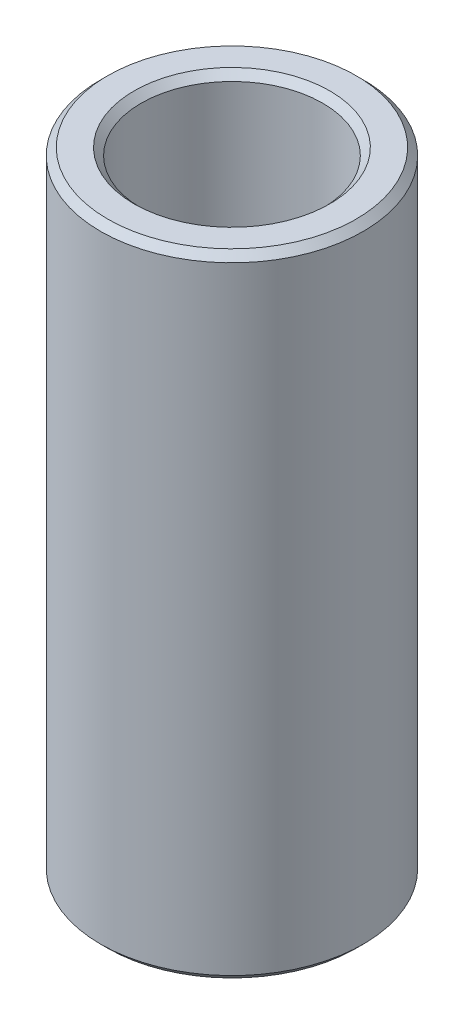
ISO-10303-21;
HEADER;
FILE_DESCRIPTION(('STEP AP214'),'2;1');
FILE_NAME('part.step','',(''),(''),'','','');
FILE_SCHEMA(('AUTOMOTIVE_DESIGN { 1 0 10303 214 1 1 1 1 }'));
ENDSEC;
DATA;
#1=APPLICATION_CONTEXT('core data for automotive mechanical design processes');
#2=APPLICATION_PROTOCOL_DEFINITION('international standard','automotive_design',2000,#1);
#3=PRODUCT_CONTEXT('',#1,'mechanical');
#4=PRODUCT('Part','Part','',(#3));
#5=PRODUCT_RELATED_PRODUCT_CATEGORY('part','',(#4));
#6=PRODUCT_DEFINITION_FORMATION('','',#4);
#7=PRODUCT_DEFINITION_CONTEXT('part definition',#1,'design');
#8=PRODUCT_DEFINITION('design','',#6,#7);
#9=PRODUCT_DEFINITION_SHAPE('','',#8);
#10=(LENGTH_UNIT() NAMED_UNIT(*) SI_UNIT(.MILLI.,.METRE.));
#11=(NAMED_UNIT(*) PLANE_ANGLE_UNIT() SI_UNIT($,.RADIAN.));
#12=(NAMED_UNIT(*) SI_UNIT($,.STERADIAN.) SOLID_ANGLE_UNIT());
#13=UNCERTAINTY_MEASURE_WITH_UNIT(LENGTH_MEASURE(1.E-05),#10,'distance_accuracy_value','');
#14=(GEOMETRIC_REPRESENTATION_CONTEXT(3) GLOBAL_UNCERTAINTY_ASSIGNED_CONTEXT((#13)) GLOBAL_UNIT_ASSIGNED_CONTEXT((#10,
#11,#12)) REPRESENTATION_CONTEXT('',''));
#15=CARTESIAN_POINT('',(0.,0.,0.));
#16=DIRECTION('',(0.,0.,1.));
#17=DIRECTION('',(1.,0.,0.));
#18=AXIS2_PLACEMENT_3D('',#15,#16,#17);
#19=CARTESIAN_POINT('',(0.,264.428492495998,0.));
#20=DIRECTION('',(0.,-1.,0.));
#21=DIRECTION('',(0.,0.,-1.));
#22=AXIS2_PLACEMENT_3D('',#19,#20,#21);
#23=CYLINDRICAL_SURFACE('',#22,55.);
#24=CARTESIAN_POINT('',(0.,2.97311401202482,0.));
#25=DIRECTION('',(0.,1.,0.));
#26=DIRECTION('',(0.,0.,1.));
#27=AXIS2_PLACEMENT_3D('',#24,#25,#26);
#28=CIRCLE('',#27,55.);
#29=CARTESIAN_POINT('',(0.,2.97311401202482,55.));
#30=VERTEX_POINT('',#29);
#31=EDGE_CURVE('E10',#30,#30,#28,.T.);
#32=ORIENTED_EDGE('',*,*,#31,.T.);
#33=EDGE_LOOP('',(#32));
#34=FACE_BOUND('',#33,.T.);
#35=CARTESIAN_POINT('',(0.,261.455378483974,0.));
#36=DIRECTION('',(0.,1.,0.));
#37=DIRECTION('',(0.,0.,1.));
#38=AXIS2_PLACEMENT_3D('',#35,#36,#37);
#39=CIRCLE('',#38,55.);
#40=CARTESIAN_POINT('',(0.,261.455378483974,55.));
#41=VERTEX_POINT('',#40);
#42=EDGE_CURVE('E50',#41,#41,#39,.F.);
#43=ORIENTED_EDGE('',*,*,#42,.T.);
#44=EDGE_LOOP('',(#43));
#45=FACE_BOUND('',#44,.T.);
#46=ADVANCED_FACE('F39',(#34,#45),#23,.T.);
#47=CARTESIAN_POINT('',(0.,264.428492495998,0.));
#48=DIRECTION('',(0.,1.,0.));
#49=DIRECTION('',(0.,0.,1.));
#50=AXIS2_PLACEMENT_3D('',#47,#48,#49);
#51=PLANE('',#50);
#52=CARTESIAN_POINT('',(0.,264.428492495998,0.));
#53=DIRECTION('',(0.,1.,0.));
#54=DIRECTION('',(0.,0.,1.));
#55=AXIS2_PLACEMENT_3D('',#52,#53,#54);
#56=CIRCLE('',#55,40.9981570646985);
#57=CARTESIAN_POINT('',(0.,264.428492495998,40.9981570646985));
#58=VERTEX_POINT('',#57);
#59=EDGE_CURVE('E58',#58,#58,#56,.F.);
#60=ORIENTED_EDGE('',*,*,#59,.T.);
#61=EDGE_LOOP('',(#60));
#62=FACE_BOUND('',#61,.T.);
#63=CARTESIAN_POINT('',(0.,264.428492495998,0.));
#64=DIRECTION('',(0.,1.,0.));
#65=DIRECTION('',(0.,0.,1.));
#66=AXIS2_PLACEMENT_3D('',#63,#64,#65);
#67=CIRCLE('',#66,52.0268859879752);
#68=CARTESIAN_POINT('',(0.,264.428492495998,52.0268859879752));
#69=VERTEX_POINT('',#68);
#70=EDGE_CURVE('E61',#69,#69,#67,.T.);
#71=ORIENTED_EDGE('',*,*,#70,.T.);
#72=EDGE_LOOP('',(#71));
#73=FACE_BOUND('',#72,.T.);
#74=ADVANCED_FACE('F88',(#62,#73),#51,.T.);
#75=CARTESIAN_POINT('',(0.,0.,0.));
#76=DIRECTION('',(0.,1.,0.));
#77=DIRECTION('',(0.,0.,1.));
#78=AXIS2_PLACEMENT_3D('',#75,#76,#77);
#79=PLANE('',#78);
#80=CARTESIAN_POINT('',(0.,0.,0.));
#81=DIRECTION('',(0.,1.,0.));
#82=DIRECTION('',(0.,0.,1.));
#83=AXIS2_PLACEMENT_3D('',#80,#81,#82);
#84=CIRCLE('',#83,40.9981570646985);
#85=CARTESIAN_POINT('',(0.,0.,40.9981570646985));
#86=VERTEX_POINT('',#85);
#87=EDGE_CURVE('E51',#86,#86,#84,.T.);
#88=ORIENTED_EDGE('',*,*,#87,.T.);
#89=EDGE_LOOP('',(#88));
#90=FACE_BOUND('',#89,.T.);
#91=CARTESIAN_POINT('',(0.,0.,0.));
#92=DIRECTION('',(0.,1.,0.));
#93=DIRECTION('',(0.,0.,1.));
#94=AXIS2_PLACEMENT_3D('',#91,#92,#93);
#95=CIRCLE('',#94,52.0268859879752);
#96=CARTESIAN_POINT('',(0.,0.,52.0268859879752));
#97=VERTEX_POINT('',#96);
#98=EDGE_CURVE('E54',#97,#97,#95,.F.);
#99=ORIENTED_EDGE('',*,*,#98,.T.);
#100=EDGE_LOOP('',(#99));
#101=FACE_BOUND('',#100,.T.);
#102=ADVANCED_FACE('F83',(#90,#101),#79,.F.);
#103=CARTESIAN_POINT('',(0.,264.428492495998,0.));
#104=DIRECTION('',(0.,-1.,0.));
#105=DIRECTION('',(0.,0.,-1.));
#106=AXIS2_PLACEMENT_3D('',#103,#104,#105);
#107=CYLINDRICAL_SURFACE('',#106,38.0250430526737);
#108=CARTESIAN_POINT('',(0.,261.455378483974,0.));
#109=DIRECTION('',(0.,1.,0.));
#110=DIRECTION('',(0.,0.,1.));
#111=AXIS2_PLACEMENT_3D('',#108,#109,#110);
#112=CIRCLE('',#111,38.0250430526737);
#113=CARTESIAN_POINT('',(0.,261.455378483974,38.0250430526737));
#114=VERTEX_POINT('',#113);
#115=EDGE_CURVE('E67',#114,#114,#112,.T.);
#116=ORIENTED_EDGE('',*,*,#115,.T.);
#117=EDGE_LOOP('',(#116));
#118=FACE_BOUND('',#117,.T.);
#119=CARTESIAN_POINT('',(0.,2.97311401202482,0.));
#120=DIRECTION('',(0.,1.,0.));
#121=DIRECTION('',(0.,0.,1.));
#122=AXIS2_PLACEMENT_3D('',#119,#120,#121);
#123=CIRCLE('',#122,38.0250430526737);
#124=CARTESIAN_POINT('',(0.,2.97311401202482,38.0250430526737));
#125=VERTEX_POINT('',#124);
#126=EDGE_CURVE('E69',#125,#125,#123,.F.);
#127=ORIENTED_EDGE('',*,*,#126,.T.);
#128=EDGE_LOOP('',(#127));
#129=FACE_BOUND('',#128,.T.);
#130=ADVANCED_FACE('F71',(#118,#129),#107,.F.);
#131=CARTESIAN_POINT('',(0.,261.455378483974,0.));
#132=DIRECTION('',(0.,1.,0.));
#133=DIRECTION('',(0.,0.,1.));
#134=AXIS2_PLACEMENT_3D('',#131,#132,#133);
#135=CONICAL_SURFACE('',#134,38.0250430526737,0.785398163397455);
#136=ORIENTED_EDGE('',*,*,#59,.F.);
#137=EDGE_LOOP('',(#136));
#138=FACE_BOUND('',#137,.T.);
#139=ORIENTED_EDGE('',*,*,#115,.F.);
#140=EDGE_LOOP('',(#139));
#141=FACE_BOUND('',#140,.T.);
#142=ADVANCED_FACE('F77',(#138,#141),#135,.F.);
#143=CARTESIAN_POINT('',(0.,0.,0.));
#144=DIRECTION('',(0.,-1.,0.));
#145=DIRECTION('',(0.,0.,-1.));
#146=AXIS2_PLACEMENT_3D('',#143,#144,#145);
#147=CONICAL_SURFACE('',#146,40.9981570646985,0.785398163397451);
#148=ORIENTED_EDGE('',*,*,#126,.F.);
#149=EDGE_LOOP('',(#148));
#150=FACE_BOUND('',#149,.T.);
#151=ORIENTED_EDGE('',*,*,#87,.F.);
#152=EDGE_LOOP('',(#151));
#153=FACE_BOUND('',#152,.T.);
#154=ADVANCED_FACE('F73',(#150,#153),#147,.F.);
#155=CARTESIAN_POINT('',(0.,2.97311401202482,0.));
#156=DIRECTION('',(0.,1.,0.));
#157=DIRECTION('',(0.,0.,1.));
#158=AXIS2_PLACEMENT_3D('',#155,#156,#157);
#159=CONICAL_SURFACE('',#158,55.,0.785398163397449);
#160=ORIENTED_EDGE('',*,*,#98,.F.);
#161=EDGE_LOOP('',(#160));
#162=FACE_BOUND('',#161,.T.);
#163=ORIENTED_EDGE('',*,*,#31,.F.);
#164=EDGE_LOOP('',(#163));
#165=FACE_BOUND('',#164,.T.);
#166=ADVANCED_FACE('F76',(#162,#165),#159,.T.);
#167=CARTESIAN_POINT('',(0.,264.428492495998,0.));
#168=DIRECTION('',(0.,-1.,0.));
#169=DIRECTION('',(0.,0.,-1.));
#170=AXIS2_PLACEMENT_3D('',#167,#168,#169);
#171=CONICAL_SURFACE('',#170,52.0268859879752,0.78539816339744);
#172=ORIENTED_EDGE('',*,*,#42,.F.);
#173=EDGE_LOOP('',(#172));
#174=FACE_BOUND('',#173,.T.);
#175=ORIENTED_EDGE('',*,*,#70,.F.);
#176=EDGE_LOOP('',(#175));
#177=FACE_BOUND('',#176,.T.);
#178=ADVANCED_FACE('F45',(#174,#177),#171,.T.);
#179=CLOSED_SHELL('',(#46,#74,#102,#130,#142,#154,#166,#178));
#180=MANIFOLD_SOLID_BREP('B2',#179);
#181=ADVANCED_BREP_SHAPE_REPRESENTATION('',(#18,#180),#14);
#182=SHAPE_DEFINITION_REPRESENTATION(#9,#181);
ENDSEC;
END-ISO-10303-21;
